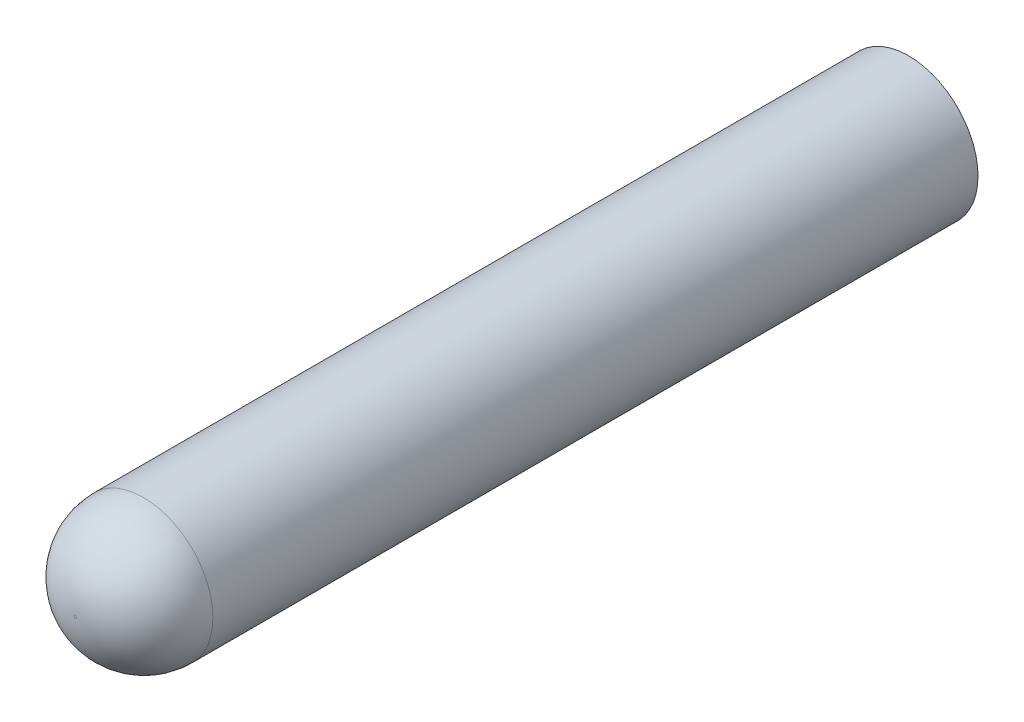
ISO-10303-21;
HEADER;
FILE_DESCRIPTION(('STEP AP214'),'2;1');
FILE_NAME('part.step','',(''),(''),'','','');
FILE_SCHEMA(('AUTOMOTIVE_DESIGN { 1 0 10303 214 1 1 1 1 }'));
ENDSEC;
DATA;
#1=APPLICATION_CONTEXT('core data for automotive mechanical design processes');
#2=APPLICATION_PROTOCOL_DEFINITION('international standard','automotive_design',2000,#1);
#3=PRODUCT_CONTEXT('',#1,'mechanical');
#4=PRODUCT('Part','Part','',(#3));
#5=PRODUCT_RELATED_PRODUCT_CATEGORY('part','',(#4));
#6=PRODUCT_DEFINITION_FORMATION('','',#4);
#7=PRODUCT_DEFINITION_CONTEXT('part definition',#1,'design');
#8=PRODUCT_DEFINITION('design','',#6,#7);
#9=PRODUCT_DEFINITION_SHAPE('','',#8);
#10=(LENGTH_UNIT() NAMED_UNIT(*) SI_UNIT(.MILLI.,.METRE.));
#11=(NAMED_UNIT(*) PLANE_ANGLE_UNIT() SI_UNIT($,.RADIAN.));
#12=(NAMED_UNIT(*) SI_UNIT($,.STERADIAN.) SOLID_ANGLE_UNIT());
#13=UNCERTAINTY_MEASURE_WITH_UNIT(LENGTH_MEASURE(1.E-05),#10,'distance_accuracy_value','');
#14=(GEOMETRIC_REPRESENTATION_CONTEXT(3) GLOBAL_UNCERTAINTY_ASSIGNED_CONTEXT((#13)) GLOBAL_UNIT_ASSIGNED_CONTEXT((#10,
#11,#12)) REPRESENTATION_CONTEXT('',''));
#15=CARTESIAN_POINT('',(0.,0.,0.));
#16=DIRECTION('',(0.,0.,1.));
#17=DIRECTION('',(1.,0.,0.));
#18=AXIS2_PLACEMENT_3D('',#15,#16,#17);
#19=CARTESIAN_POINT('',(0.,0.,6.));
#20=DIRECTION('',(0.,0.,-1.));
#21=DIRECTION('',(-1.,0.,0.));
#22=AXIS2_PLACEMENT_3D('',#19,#20,#21);
#23=CYLINDRICAL_SURFACE('',#22,0.5);
#24=CARTESIAN_POINT('',(0.,0.,5.51));
#25=DIRECTION('',(0.,0.,1.));
#26=DIRECTION('',(1.,0.,0.));
#27=AXIS2_PLACEMENT_3D('',#24,#25,#26);
#28=CIRCLE('',#27,0.5);
#29=CARTESIAN_POINT('',(0.5,0.,5.51));
#30=VERTEX_POINT('',#29);
#31=EDGE_CURVE('E10',#30,#30,#28,.F.);
#32=ORIENTED_EDGE('',*,*,#31,.T.);
#33=EDGE_LOOP('',(#32));
#34=FACE_BOUND('',#33,.T.);
#35=CARTESIAN_POINT('',(0.,0.,0.));
#36=DIRECTION('',(0.,0.,1.));
#37=DIRECTION('',(1.,0.,0.));
#38=AXIS2_PLACEMENT_3D('',#35,#36,#37);
#39=CIRCLE('',#38,0.5);
#40=CARTESIAN_POINT('',(0.5,0.,0.));
#41=VERTEX_POINT('',#40);
#42=EDGE_CURVE('E41',#41,#41,#39,.T.);
#43=ORIENTED_EDGE('',*,*,#42,.T.);
#44=EDGE_LOOP('',(#43));
#45=FACE_BOUND('',#44,.T.);
#46=ADVANCED_FACE('F30',(#34,#45),#23,.T.);
#47=CARTESIAN_POINT('',(0.,0.,6.));
#48=DIRECTION('',(0.,0.,1.));
#49=DIRECTION('',(1.,0.,0.));
#50=AXIS2_PLACEMENT_3D('',#47,#48,#49);
#51=PLANE('',#50);
#52=CARTESIAN_POINT('',(0.,0.,6.));
#53=DIRECTION('',(0.,0.,1.));
#54=DIRECTION('',(1.,0.,0.));
#55=AXIS2_PLACEMENT_3D('',#52,#53,#54);
#56=CIRCLE('',#55,0.01);
#57=CARTESIAN_POINT('',(0.01,0.,6.));
#58=VERTEX_POINT('',#57);
#59=EDGE_CURVE('E37',#58,#58,#56,.T.);
#60=ORIENTED_EDGE('',*,*,#59,.T.);
#61=EDGE_LOOP('',(#60));
#62=FACE_BOUND('',#61,.T.);
#63=ADVANCED_FACE('F51',(#62),#51,.T.);
#64=CARTESIAN_POINT('',(0.,0.,0.));
#65=DIRECTION('',(0.,0.,1.));
#66=DIRECTION('',(1.,0.,0.));
#67=AXIS2_PLACEMENT_3D('',#64,#65,#66);
#68=PLANE('',#67);
#69=ORIENTED_EDGE('',*,*,#42,.F.);
#70=EDGE_LOOP('',(#69));
#71=FACE_BOUND('',#70,.T.);
#72=ADVANCED_FACE('F49',(#71),#68,.F.);
#73=CARTESIAN_POINT('',(0.,0.,5.51));
#74=DIRECTION('',(0.,0.,1.));
#75=DIRECTION('',(1.,0.,0.));
#76=AXIS2_PLACEMENT_3D('',#73,#74,#75);
#77=DEGENERATE_TOROIDAL_SURFACE('',#76,0.01,0.49,.T.);
#78=ORIENTED_EDGE('',*,*,#31,.F.);
#79=EDGE_LOOP('',(#78));
#80=FACE_BOUND('',#79,.T.);
#81=ORIENTED_EDGE('',*,*,#59,.F.);
#82=EDGE_LOOP('',(#81));
#83=FACE_BOUND('',#82,.T.);
#84=ADVANCED_FACE('F32',(#80,#83),#77,.T.);
#85=CLOSED_SHELL('',(#46,#63,#72,#84));
#86=MANIFOLD_SOLID_BREP('B2',#85);
#87=ADVANCED_BREP_SHAPE_REPRESENTATION('',(#18,#86),#14);
#88=SHAPE_DEFINITION_REPRESENTATION(#9,#87);
ENDSEC;
END-ISO-10303-21;
